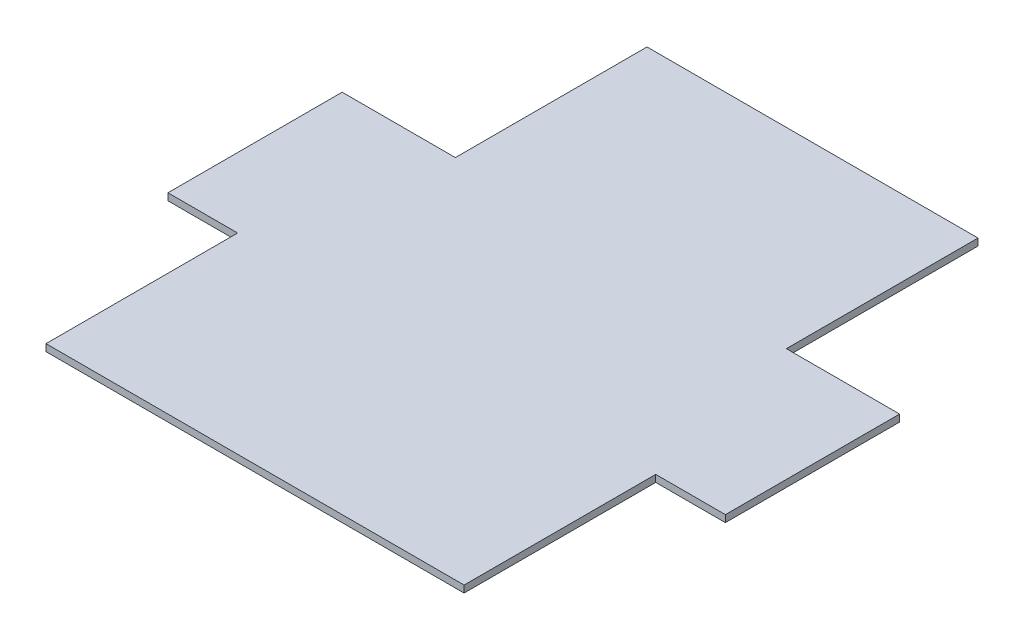
ISO-10303-21;
HEADER;
FILE_DESCRIPTION(('STEP AP214'),'2;1');
FILE_NAME('part.step','',(''),(''),'','','');
FILE_SCHEMA(('AUTOMOTIVE_DESIGN { 1 0 10303 214 1 1 1 1 }'));
ENDSEC;
DATA;
#1=APPLICATION_CONTEXT('core data for automotive mechanical design processes');
#2=APPLICATION_PROTOCOL_DEFINITION('international standard','automotive_design',2000,#1);
#3=PRODUCT_CONTEXT('',#1,'mechanical');
#4=PRODUCT('Part','Part','',(#3));
#5=PRODUCT_RELATED_PRODUCT_CATEGORY('part','',(#4));
#6=PRODUCT_DEFINITION_FORMATION('','',#4);
#7=PRODUCT_DEFINITION_CONTEXT('part definition',#1,'design');
#8=PRODUCT_DEFINITION('design','',#6,#7);
#9=PRODUCT_DEFINITION_SHAPE('','',#8);
#10=(LENGTH_UNIT() NAMED_UNIT(*) SI_UNIT(.MILLI.,.METRE.));
#11=(NAMED_UNIT(*) PLANE_ANGLE_UNIT() SI_UNIT($,.RADIAN.));
#12=(NAMED_UNIT(*) SI_UNIT($,.STERADIAN.) SOLID_ANGLE_UNIT());
#13=UNCERTAINTY_MEASURE_WITH_UNIT(LENGTH_MEASURE(1.E-05),#10,'distance_accuracy_value','');
#14=(GEOMETRIC_REPRESENTATION_CONTEXT(3) GLOBAL_UNCERTAINTY_ASSIGNED_CONTEXT((#13)) GLOBAL_UNIT_ASSIGNED_CONTEXT((#10,
#11,#12)) REPRESENTATION_CONTEXT('',''));
#15=CARTESIAN_POINT('',(0.,0.,0.));
#16=DIRECTION('',(0.,0.,1.));
#17=DIRECTION('',(1.,0.,0.));
#18=AXIS2_PLACEMENT_3D('',#15,#16,#17);
#19=CARTESIAN_POINT('',(-47.5,2.,-80.));
#20=DIRECTION('',(1.,0.,0.));
#21=DIRECTION('',(0.,0.,-1.));
#22=AXIS2_PLACEMENT_3D('',#19,#20,#21);
#23=PLANE('',#22);
#24=DIRECTION('',(0.,0.,1.));
#25=VECTOR('',#24,1.);
#26=CARTESIAN_POINT('',(-47.5,0.,-80.));
#27=LINE('',#26,#25);
#28=CARTESIAN_POINT('',(-47.5,0.,-80.));
#29=VERTEX_POINT('',#28);
#30=CARTESIAN_POINT('',(-47.5,0.,-25.));
#31=VERTEX_POINT('',#30);
#32=EDGE_CURVE('E154',#29,#31,#27,.T.);
#33=ORIENTED_EDGE('',*,*,#32,.T.);
#34=DIRECTION('',(0.,-1.,0.));
#35=VECTOR('',#34,1.);
#36=CARTESIAN_POINT('',(-47.5,2.,-25.));
#37=LINE('',#36,#35);
#38=CARTESIAN_POINT('',(-47.5,2.,-25.));
#39=VERTEX_POINT('',#38);
#40=EDGE_CURVE('E11',#39,#31,#37,.T.);
#41=ORIENTED_EDGE('',*,*,#40,.F.);
#42=DIRECTION('',(0.,0.,1.));
#43=VECTOR('',#42,1.);
#44=CARTESIAN_POINT('',(-47.5,2.,-80.));
#45=LINE('',#44,#43);
#46=CARTESIAN_POINT('',(-47.5,2.,-80.));
#47=VERTEX_POINT('',#46);
#48=EDGE_CURVE('E176',#47,#39,#45,.T.);
#49=ORIENTED_EDGE('',*,*,#48,.F.);
#50=DIRECTION('',(0.,-1.,0.));
#51=VECTOR('',#50,1.);
#52=CARTESIAN_POINT('',(-47.5,2.,-80.));
#53=LINE('',#52,#51);
#54=EDGE_CURVE('E150',#47,#29,#53,.T.);
#55=ORIENTED_EDGE('',*,*,#54,.T.);
#56=EDGE_LOOP('',(#33,#41,#49,#55));
#57=FACE_BOUND('',#56,.T.);
#58=ADVANCED_FACE('F34',(#57),#23,.F.);
#59=CARTESIAN_POINT('',(-80.,2.,-25.));
#60=DIRECTION('',(0.,0.,1.));
#61=DIRECTION('',(1.,0.,0.));
#62=AXIS2_PLACEMENT_3D('',#59,#60,#61);
#63=PLANE('',#62);
#64=DIRECTION('',(-1.,0.,0.));
#65=VECTOR('',#64,1.);
#66=CARTESIAN_POINT('',(-80.,0.,-25.));
#67=LINE('',#66,#65);
#68=CARTESIAN_POINT('',(-80.,0.,-25.));
#69=VERTEX_POINT('',#68);
#70=EDGE_CURVE('E157',#31,#69,#67,.T.);
#71=ORIENTED_EDGE('',*,*,#70,.T.);
#72=DIRECTION('',(0.,-1.,0.));
#73=VECTOR('',#72,1.);
#74=CARTESIAN_POINT('',(-80.,2.,-25.));
#75=LINE('',#74,#73);
#76=CARTESIAN_POINT('',(-80.,2.,-25.));
#77=VERTEX_POINT('',#76);
#78=EDGE_CURVE('E42',#77,#69,#75,.T.);
#79=ORIENTED_EDGE('',*,*,#78,.F.);
#80=DIRECTION('',(-1.,0.,0.));
#81=VECTOR('',#80,1.);
#82=CARTESIAN_POINT('',(-80.,2.,-25.));
#83=LINE('',#82,#81);
#84=EDGE_CURVE('E105',#39,#77,#83,.T.);
#85=ORIENTED_EDGE('',*,*,#84,.F.);
#86=ORIENTED_EDGE('',*,*,#40,.T.);
#87=EDGE_LOOP('',(#71,#79,#85,#86));
#88=FACE_BOUND('',#87,.T.);
#89=ADVANCED_FACE('F254',(#88),#63,.F.);
#90=CARTESIAN_POINT('',(-80.,2.,-25.));
#91=DIRECTION('',(1.,0.,0.));
#92=DIRECTION('',(0.,0.,-1.));
#93=AXIS2_PLACEMENT_3D('',#90,#91,#92);
#94=PLANE('',#93);
#95=DIRECTION('',(0.,0.,1.));
#96=VECTOR('',#95,1.);
#97=CARTESIAN_POINT('',(-80.,0.,-25.));
#98=LINE('',#97,#96);
#99=CARTESIAN_POINT('',(-80.,0.,25.));
#100=VERTEX_POINT('',#99);
#101=EDGE_CURVE('E159',#69,#100,#98,.T.);
#102=ORIENTED_EDGE('',*,*,#101,.T.);
#103=DIRECTION('',(0.,-1.,0.));
#104=VECTOR('',#103,1.);
#105=CARTESIAN_POINT('',(-80.,2.,25.));
#106=LINE('',#105,#104);
#107=CARTESIAN_POINT('',(-80.,2.,25.));
#108=VERTEX_POINT('',#107);
#109=EDGE_CURVE('E195',#108,#100,#106,.T.);
#110=ORIENTED_EDGE('',*,*,#109,.F.);
#111=DIRECTION('',(0.,0.,1.));
#112=VECTOR('',#111,1.);
#113=CARTESIAN_POINT('',(-80.,2.,-25.));
#114=LINE('',#113,#112);
#115=EDGE_CURVE('E203',#77,#108,#114,.T.);
#116=ORIENTED_EDGE('',*,*,#115,.F.);
#117=ORIENTED_EDGE('',*,*,#78,.T.);
#118=EDGE_LOOP('',(#102,#110,#116,#117));
#119=FACE_BOUND('',#118,.T.);
#120=ADVANCED_FACE('F201',(#119),#94,.F.);
#121=CARTESIAN_POINT('',(-80.,2.,25.));
#122=DIRECTION('',(0.,0.,-1.));
#123=DIRECTION('',(-1.,0.,0.));
#124=AXIS2_PLACEMENT_3D('',#121,#122,#123);
#125=PLANE('',#124);
#126=DIRECTION('',(1.,0.,0.));
#127=VECTOR('',#126,1.);
#128=CARTESIAN_POINT('',(-80.,0.,25.));
#129=LINE('',#128,#127);
#130=CARTESIAN_POINT('',(-60.,0.,25.));
#131=VERTEX_POINT('',#130);
#132=EDGE_CURVE('E161',#100,#131,#129,.T.);
#133=ORIENTED_EDGE('',*,*,#132,.T.);
#134=DIRECTION('',(0.,-1.,0.));
#135=VECTOR('',#134,1.);
#136=CARTESIAN_POINT('',(-60.,2.,25.));
#137=LINE('',#136,#135);
#138=CARTESIAN_POINT('',(-60.,2.,25.));
#139=VERTEX_POINT('',#138);
#140=EDGE_CURVE('E192',#139,#131,#137,.T.);
#141=ORIENTED_EDGE('',*,*,#140,.F.);
#142=DIRECTION('',(1.,0.,0.));
#143=VECTOR('',#142,1.);
#144=CARTESIAN_POINT('',(-80.,2.,25.));
#145=LINE('',#144,#143);
#146=EDGE_CURVE('E221',#108,#139,#145,.T.);
#147=ORIENTED_EDGE('',*,*,#146,.F.);
#148=ORIENTED_EDGE('',*,*,#109,.T.);
#149=EDGE_LOOP('',(#133,#141,#147,#148));
#150=FACE_BOUND('',#149,.T.);
#151=ADVANCED_FACE('F212',(#150),#125,.F.);
#152=CARTESIAN_POINT('',(-60.,2.,25.));
#153=DIRECTION('',(1.,0.,0.));
#154=DIRECTION('',(0.,0.,-1.));
#155=AXIS2_PLACEMENT_3D('',#152,#153,#154);
#156=PLANE('',#155);
#157=DIRECTION('',(0.,0.,1.));
#158=VECTOR('',#157,1.);
#159=CARTESIAN_POINT('',(-60.,0.,25.));
#160=LINE('',#159,#158);
#161=CARTESIAN_POINT('',(-60.,0.,80.));
#162=VERTEX_POINT('',#161);
#163=EDGE_CURVE('E163',#131,#162,#160,.T.);
#164=ORIENTED_EDGE('',*,*,#163,.T.);
#165=DIRECTION('',(0.,-1.,0.));
#166=VECTOR('',#165,1.);
#167=CARTESIAN_POINT('',(-60.,2.,80.));
#168=LINE('',#167,#166);
#169=CARTESIAN_POINT('',(-60.,2.,80.));
#170=VERTEX_POINT('',#169);
#171=EDGE_CURVE('E189',#170,#162,#168,.T.);
#172=ORIENTED_EDGE('',*,*,#171,.F.);
#173=DIRECTION('',(0.,0.,1.));
#174=VECTOR('',#173,1.);
#175=CARTESIAN_POINT('',(-60.,2.,25.));
#176=LINE('',#175,#174);
#177=EDGE_CURVE('E218',#139,#170,#176,.T.);
#178=ORIENTED_EDGE('',*,*,#177,.F.);
#179=ORIENTED_EDGE('',*,*,#140,.T.);
#180=EDGE_LOOP('',(#164,#172,#178,#179));
#181=FACE_BOUND('',#180,.T.);
#182=ADVANCED_FACE('F216',(#181),#156,.F.);
#183=CARTESIAN_POINT('',(-60.,2.,80.));
#184=DIRECTION('',(0.,0.,-1.));
#185=DIRECTION('',(-1.,0.,0.));
#186=AXIS2_PLACEMENT_3D('',#183,#184,#185);
#187=PLANE('',#186);
#188=DIRECTION('',(1.,0.,0.));
#189=VECTOR('',#188,1.);
#190=CARTESIAN_POINT('',(-60.,0.,80.));
#191=LINE('',#190,#189);
#192=CARTESIAN_POINT('',(60.,0.,80.));
#193=VERTEX_POINT('',#192);
#194=EDGE_CURVE('E165',#162,#193,#191,.T.);
#195=ORIENTED_EDGE('',*,*,#194,.T.);
#196=DIRECTION('',(0.,-1.,0.));
#197=VECTOR('',#196,1.);
#198=CARTESIAN_POINT('',(60.,2.,80.));
#199=LINE('',#198,#197);
#200=CARTESIAN_POINT('',(60.,2.,80.));
#201=VERTEX_POINT('',#200);
#202=EDGE_CURVE('E186',#201,#193,#199,.T.);
#203=ORIENTED_EDGE('',*,*,#202,.F.);
#204=DIRECTION('',(1.,0.,0.));
#205=VECTOR('',#204,1.);
#206=CARTESIAN_POINT('',(-60.,2.,80.));
#207=LINE('',#206,#205);
#208=EDGE_CURVE('E220',#170,#201,#207,.T.);
#209=ORIENTED_EDGE('',*,*,#208,.F.);
#210=ORIENTED_EDGE('',*,*,#171,.T.);
#211=EDGE_LOOP('',(#195,#203,#209,#210));
#212=FACE_BOUND('',#211,.T.);
#213=ADVANCED_FACE('F267',(#212),#187,.F.);
#214=CARTESIAN_POINT('',(60.,2.,25.));
#215=DIRECTION('',(-1.,0.,0.));
#216=DIRECTION('',(0.,0.,1.));
#217=AXIS2_PLACEMENT_3D('',#214,#215,#216);
#218=PLANE('',#217);
#219=DIRECTION('',(0.,0.,-1.));
#220=VECTOR('',#219,1.);
#221=CARTESIAN_POINT('',(60.,0.,25.));
#222=LINE('',#221,#220);
#223=CARTESIAN_POINT('',(60.,0.,25.));
#224=VERTEX_POINT('',#223);
#225=EDGE_CURVE('E167',#193,#224,#222,.T.);
#226=ORIENTED_EDGE('',*,*,#225,.T.);
#227=DIRECTION('',(0.,-1.,0.));
#228=VECTOR('',#227,1.);
#229=CARTESIAN_POINT('',(60.,2.,25.));
#230=LINE('',#229,#228);
#231=CARTESIAN_POINT('',(60.,2.,25.));
#232=VERTEX_POINT('',#231);
#233=EDGE_CURVE('E183',#232,#224,#230,.T.);
#234=ORIENTED_EDGE('',*,*,#233,.F.);
#235=DIRECTION('',(0.,0.,-1.));
#236=VECTOR('',#235,1.);
#237=CARTESIAN_POINT('',(60.,2.,25.));
#238=LINE('',#237,#236);
#239=EDGE_CURVE('E223',#201,#232,#238,.T.);
#240=ORIENTED_EDGE('',*,*,#239,.F.);
#241=ORIENTED_EDGE('',*,*,#202,.T.);
#242=EDGE_LOOP('',(#226,#234,#240,#241));
#243=FACE_BOUND('',#242,.T.);
#244=ADVANCED_FACE('F270',(#243),#218,.F.);
#245=CARTESIAN_POINT('',(60.,2.,25.));
#246=DIRECTION('',(0.,0.,-1.));
#247=DIRECTION('',(-1.,0.,0.));
#248=AXIS2_PLACEMENT_3D('',#245,#246,#247);
#249=PLANE('',#248);
#250=DIRECTION('',(1.,0.,0.));
#251=VECTOR('',#250,1.);
#252=CARTESIAN_POINT('',(60.,0.,25.));
#253=LINE('',#252,#251);
#254=CARTESIAN_POINT('',(80.,0.,25.));
#255=VERTEX_POINT('',#254);
#256=EDGE_CURVE('E169',#224,#255,#253,.T.);
#257=ORIENTED_EDGE('',*,*,#256,.T.);
#258=DIRECTION('',(0.,-1.,0.));
#259=VECTOR('',#258,1.);
#260=CARTESIAN_POINT('',(80.,2.,25.));
#261=LINE('',#260,#259);
#262=CARTESIAN_POINT('',(80.,2.,25.));
#263=VERTEX_POINT('',#262);
#264=EDGE_CURVE('E180',#263,#255,#261,.T.);
#265=ORIENTED_EDGE('',*,*,#264,.F.);
#266=DIRECTION('',(1.,0.,0.));
#267=VECTOR('',#266,1.);
#268=CARTESIAN_POINT('',(60.,2.,25.));
#269=LINE('',#268,#267);
#270=EDGE_CURVE('E229',#232,#263,#269,.T.);
#271=ORIENTED_EDGE('',*,*,#270,.F.);
#272=ORIENTED_EDGE('',*,*,#233,.T.);
#273=EDGE_LOOP('',(#257,#265,#271,#272));
#274=FACE_BOUND('',#273,.T.);
#275=ADVANCED_FACE('F235',(#274),#249,.F.);
#276=CARTESIAN_POINT('',(80.,2.,-25.));
#277=DIRECTION('',(-1.,0.,0.));
#278=DIRECTION('',(0.,0.,1.));
#279=AXIS2_PLACEMENT_3D('',#276,#277,#278);
#280=PLANE('',#279);
#281=DIRECTION('',(0.,0.,-1.));
#282=VECTOR('',#281,1.);
#283=CARTESIAN_POINT('',(80.,0.,-25.));
#284=LINE('',#283,#282);
#285=CARTESIAN_POINT('',(80.,0.,-25.));
#286=VERTEX_POINT('',#285);
#287=EDGE_CURVE('E171',#255,#286,#284,.T.);
#288=ORIENTED_EDGE('',*,*,#287,.T.);
#289=DIRECTION('',(0.,-1.,0.));
#290=VECTOR('',#289,1.);
#291=CARTESIAN_POINT('',(80.,2.,-25.));
#292=LINE('',#291,#290);
#293=CARTESIAN_POINT('',(80.,2.,-25.));
#294=VERTEX_POINT('',#293);
#295=EDGE_CURVE('E145',#294,#286,#292,.T.);
#296=ORIENTED_EDGE('',*,*,#295,.F.);
#297=DIRECTION('',(0.,0.,-1.));
#298=VECTOR('',#297,1.);
#299=CARTESIAN_POINT('',(80.,2.,-25.));
#300=LINE('',#299,#298);
#301=EDGE_CURVE('E136',#263,#294,#300,.T.);
#302=ORIENTED_EDGE('',*,*,#301,.F.);
#303=ORIENTED_EDGE('',*,*,#264,.T.);
#304=EDGE_LOOP('',(#288,#296,#302,#303));
#305=FACE_BOUND('',#304,.T.);
#306=ADVANCED_FACE('F239',(#305),#280,.F.);
#307=CARTESIAN_POINT('',(47.5,2.,-25.));
#308=DIRECTION('',(0.,0.,1.));
#309=DIRECTION('',(1.,0.,0.));
#310=AXIS2_PLACEMENT_3D('',#307,#308,#309);
#311=PLANE('',#310);
#312=DIRECTION('',(-1.,0.,0.));
#313=VECTOR('',#312,1.);
#314=CARTESIAN_POINT('',(47.5,0.,-25.));
#315=LINE('',#314,#313);
#316=CARTESIAN_POINT('',(47.5,0.,-25.));
#317=VERTEX_POINT('',#316);
#318=EDGE_CURVE('E144',#286,#317,#315,.T.);
#319=ORIENTED_EDGE('',*,*,#318,.T.);
#320=DIRECTION('',(0.,-1.,0.));
#321=VECTOR('',#320,1.);
#322=CARTESIAN_POINT('',(47.5,2.,-25.));
#323=LINE('',#322,#321);
#324=CARTESIAN_POINT('',(47.5,2.,-25.));
#325=VERTEX_POINT('',#324);
#326=EDGE_CURVE('E141',#325,#317,#323,.T.);
#327=ORIENTED_EDGE('',*,*,#326,.F.);
#328=DIRECTION('',(-1.,0.,0.));
#329=VECTOR('',#328,1.);
#330=CARTESIAN_POINT('',(47.5,2.,-25.));
#331=LINE('',#330,#329);
#332=EDGE_CURVE('E130',#294,#325,#331,.T.);
#333=ORIENTED_EDGE('',*,*,#332,.F.);
#334=ORIENTED_EDGE('',*,*,#295,.T.);
#335=EDGE_LOOP('',(#319,#327,#333,#334));
#336=FACE_BOUND('',#335,.T.);
#337=ADVANCED_FACE('F142',(#336),#311,.F.);
#338=CARTESIAN_POINT('',(47.5,2.,-80.));
#339=DIRECTION('',(-1.,0.,0.));
#340=DIRECTION('',(0.,0.,1.));
#341=AXIS2_PLACEMENT_3D('',#338,#339,#340);
#342=PLANE('',#341);
#343=DIRECTION('',(0.,0.,-1.));
#344=VECTOR('',#343,1.);
#345=CARTESIAN_POINT('',(47.5,0.,-80.));
#346=LINE('',#345,#344);
#347=CARTESIAN_POINT('',(47.5,0.,-80.));
#348=VERTEX_POINT('',#347);
#349=EDGE_CURVE('E91',#317,#348,#346,.T.);
#350=ORIENTED_EDGE('',*,*,#349,.T.);
#351=DIRECTION('',(0.,-1.,0.));
#352=VECTOR('',#351,1.);
#353=CARTESIAN_POINT('',(47.5,2.,-80.));
#354=LINE('',#353,#352);
#355=CARTESIAN_POINT('',(47.5,2.,-80.));
#356=VERTEX_POINT('',#355);
#357=EDGE_CURVE('E146',#356,#348,#354,.T.);
#358=ORIENTED_EDGE('',*,*,#357,.F.);
#359=DIRECTION('',(0.,0.,-1.));
#360=VECTOR('',#359,1.);
#361=CARTESIAN_POINT('',(47.5,2.,-80.));
#362=LINE('',#361,#360);
#363=EDGE_CURVE('E134',#325,#356,#362,.T.);
#364=ORIENTED_EDGE('',*,*,#363,.F.);
#365=ORIENTED_EDGE('',*,*,#326,.T.);
#366=EDGE_LOOP('',(#350,#358,#364,#365));
#367=FACE_BOUND('',#366,.T.);
#368=ADVANCED_FACE('F148',(#367),#342,.F.);
#369=CARTESIAN_POINT('',(-47.5,2.,-80.));
#370=DIRECTION('',(0.,0.,1.));
#371=DIRECTION('',(1.,0.,0.));
#372=AXIS2_PLACEMENT_3D('',#369,#370,#371);
#373=PLANE('',#372);
#374=DIRECTION('',(-1.,0.,0.));
#375=VECTOR('',#374,1.);
#376=CARTESIAN_POINT('',(-47.5,0.,-80.));
#377=LINE('',#376,#375);
#378=EDGE_CURVE('E97',#348,#29,#377,.T.);
#379=ORIENTED_EDGE('',*,*,#378,.T.);
#380=ORIENTED_EDGE('',*,*,#54,.F.);
#381=DIRECTION('',(-1.,0.,0.));
#382=VECTOR('',#381,1.);
#383=CARTESIAN_POINT('',(-47.5,2.,-80.));
#384=LINE('',#383,#382);
#385=EDGE_CURVE('E50',#356,#47,#384,.T.);
#386=ORIENTED_EDGE('',*,*,#385,.F.);
#387=ORIENTED_EDGE('',*,*,#357,.T.);
#388=EDGE_LOOP('',(#379,#380,#386,#387));
#389=FACE_BOUND('',#388,.T.);
#390=ADVANCED_FACE('F243',(#389),#373,.F.);
#391=CARTESIAN_POINT('',(-47.5,2.,-25.));
#392=DIRECTION('',(0.,1.,0.));
#393=DIRECTION('',(0.,0.,1.));
#394=AXIS2_PLACEMENT_3D('',#391,#392,#393);
#395=PLANE('',#394);
#396=ORIENTED_EDGE('',*,*,#48,.T.);
#397=ORIENTED_EDGE('',*,*,#84,.T.);
#398=ORIENTED_EDGE('',*,*,#115,.T.);
#399=ORIENTED_EDGE('',*,*,#146,.T.);
#400=ORIENTED_EDGE('',*,*,#177,.T.);
#401=ORIENTED_EDGE('',*,*,#208,.T.);
#402=ORIENTED_EDGE('',*,*,#239,.T.);
#403=ORIENTED_EDGE('',*,*,#270,.T.);
#404=ORIENTED_EDGE('',*,*,#301,.T.);
#405=ORIENTED_EDGE('',*,*,#332,.T.);
#406=ORIENTED_EDGE('',*,*,#363,.T.);
#407=ORIENTED_EDGE('',*,*,#385,.T.);
#408=EDGE_LOOP('',(#396,#397,#398,#399,#400,#401,#402,#403,#404,#405,#406,#407));
#409=FACE_BOUND('',#408,.T.);
#410=ADVANCED_FACE('F132',(#409),#395,.T.);
#411=CARTESIAN_POINT('',(-47.5,0.,-25.));
#412=DIRECTION('',(0.,1.,0.));
#413=DIRECTION('',(0.,0.,1.));
#414=AXIS2_PLACEMENT_3D('',#411,#412,#413);
#415=PLANE('',#414);
#416=ORIENTED_EDGE('',*,*,#32,.F.);
#417=ORIENTED_EDGE('',*,*,#378,.F.);
#418=ORIENTED_EDGE('',*,*,#349,.F.);
#419=ORIENTED_EDGE('',*,*,#318,.F.);
#420=ORIENTED_EDGE('',*,*,#287,.F.);
#421=ORIENTED_EDGE('',*,*,#256,.F.);
#422=ORIENTED_EDGE('',*,*,#225,.F.);
#423=ORIENTED_EDGE('',*,*,#194,.F.);
#424=ORIENTED_EDGE('',*,*,#163,.F.);
#425=ORIENTED_EDGE('',*,*,#132,.F.);
#426=ORIENTED_EDGE('',*,*,#101,.F.);
#427=ORIENTED_EDGE('',*,*,#70,.F.);
#428=EDGE_LOOP('',(#416,#417,#418,#419,#420,#421,#422,#423,#424,#425,#426,#427));
#429=FACE_BOUND('',#428,.T.);
#430=ADVANCED_FACE('F207',(#429),#415,.F.);
#431=CLOSED_SHELL('',(#58,#89,#120,#151,#182,#213,#244,#275,#306,#337,#368,#390,#410,#430));
#432=MANIFOLD_SOLID_BREP('B2',#431);
#433=ADVANCED_BREP_SHAPE_REPRESENTATION('',(#18,#432),#14);
#434=SHAPE_DEFINITION_REPRESENTATION(#9,#433);
ENDSEC;
END-ISO-10303-21;
